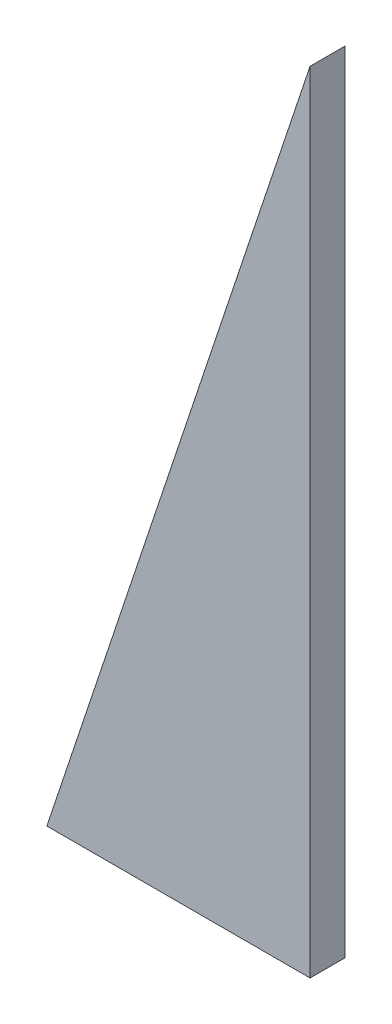
ISO-10303-21;
HEADER;
FILE_DESCRIPTION(('STEP AP214'),'2;1');
FILE_NAME('part.step','',(''),(''),'','','');
FILE_SCHEMA(('AUTOMOTIVE_DESIGN { 1 0 10303 214 1 1 1 1 }'));
ENDSEC;
DATA;
#1=APPLICATION_CONTEXT('core data for automotive mechanical design processes');
#2=APPLICATION_PROTOCOL_DEFINITION('international standard','automotive_design',2000,#1);
#3=PRODUCT_CONTEXT('',#1,'mechanical');
#4=PRODUCT('Part','Part','',(#3));
#5=PRODUCT_RELATED_PRODUCT_CATEGORY('part','',(#4));
#6=PRODUCT_DEFINITION_FORMATION('','',#4);
#7=PRODUCT_DEFINITION_CONTEXT('part definition',#1,'design');
#8=PRODUCT_DEFINITION('design','',#6,#7);
#9=PRODUCT_DEFINITION_SHAPE('','',#8);
#10=(LENGTH_UNIT() NAMED_UNIT(*) SI_UNIT(.MILLI.,.METRE.));
#11=(NAMED_UNIT(*) PLANE_ANGLE_UNIT() SI_UNIT($,.RADIAN.));
#12=(NAMED_UNIT(*) SI_UNIT($,.STERADIAN.) SOLID_ANGLE_UNIT());
#13=UNCERTAINTY_MEASURE_WITH_UNIT(LENGTH_MEASURE(1.E-05),#10,'distance_accuracy_value','');
#14=(GEOMETRIC_REPRESENTATION_CONTEXT(3) GLOBAL_UNCERTAINTY_ASSIGNED_CONTEXT((#13)) GLOBAL_UNIT_ASSIGNED_CONTEXT((#10,
#11,#12)) REPRESENTATION_CONTEXT('',''));
#15=CARTESIAN_POINT('',(0.,0.,0.));
#16=DIRECTION('',(0.,0.,1.));
#17=DIRECTION('',(1.,0.,0.));
#18=AXIS2_PLACEMENT_3D('',#15,#16,#17);
#19=CARTESIAN_POINT('',(-60.,0.,4.));
#20=DIRECTION('',(0.,1.,0.));
#21=DIRECTION('',(0.,0.,1.));
#22=AXIS2_PLACEMENT_3D('',#19,#20,#21);
#23=PLANE('',#22);
#24=DIRECTION('',(1.,0.,0.));
#25=VECTOR('',#24,1.);
#26=CARTESIAN_POINT('',(-60.,0.,-4.));
#27=LINE('',#26,#25);
#28=CARTESIAN_POINT('',(-60.,0.,-4.));
#29=VERTEX_POINT('',#28);
#30=CARTESIAN_POINT('',(0.,0.,-4.));
#31=VERTEX_POINT('',#30);
#32=EDGE_CURVE('E81',#29,#31,#27,.T.);
#33=ORIENTED_EDGE('',*,*,#32,.T.);
#34=DIRECTION('',(0.,0.,-1.));
#35=VECTOR('',#34,1.);
#36=CARTESIAN_POINT('',(0.,0.,4.));
#37=LINE('',#36,#35);
#38=CARTESIAN_POINT('',(0.,0.,4.));
#39=VERTEX_POINT('',#38);
#40=EDGE_CURVE('E11',#39,#31,#37,.T.);
#41=ORIENTED_EDGE('',*,*,#40,.F.);
#42=DIRECTION('',(1.,0.,0.));
#43=VECTOR('',#42,1.);
#44=CARTESIAN_POINT('',(-60.,0.,4.));
#45=LINE('',#44,#43);
#46=CARTESIAN_POINT('',(-60.,0.,4.));
#47=VERTEX_POINT('',#46);
#48=EDGE_CURVE('E74',#47,#39,#45,.T.);
#49=ORIENTED_EDGE('',*,*,#48,.F.);
#50=DIRECTION('',(0.,0.,-1.));
#51=VECTOR('',#50,1.);
#52=CARTESIAN_POINT('',(-60.,0.,4.));
#53=LINE('',#52,#51);
#54=EDGE_CURVE('E82',#47,#29,#53,.T.);
#55=ORIENTED_EDGE('',*,*,#54,.T.);
#56=EDGE_LOOP('',(#33,#41,#49,#55));
#57=FACE_BOUND('',#56,.T.);
#58=ADVANCED_FACE('F34',(#57),#23,.F.);
#59=CARTESIAN_POINT('',(0.,0.,4.));
#60=DIRECTION('',(-1.,0.,0.));
#61=DIRECTION('',(0.,0.,1.));
#62=AXIS2_PLACEMENT_3D('',#59,#60,#61);
#63=PLANE('',#62);
#64=DIRECTION('',(0.,1.,0.));
#65=VECTOR('',#64,1.);
#66=CARTESIAN_POINT('',(0.,0.,-4.));
#67=LINE('',#66,#65);
#68=CARTESIAN_POINT('',(0.,180.,-4.));
#69=VERTEX_POINT('',#68);
#70=EDGE_CURVE('E62',#31,#69,#67,.T.);
#71=ORIENTED_EDGE('',*,*,#70,.T.);
#72=DIRECTION('',(0.,0.,-1.));
#73=VECTOR('',#72,1.);
#74=CARTESIAN_POINT('',(0.,180.,4.));
#75=LINE('',#74,#73);
#76=CARTESIAN_POINT('',(0.,180.,4.));
#77=VERTEX_POINT('',#76);
#78=EDGE_CURVE('E42',#77,#69,#75,.T.);
#79=ORIENTED_EDGE('',*,*,#78,.F.);
#80=DIRECTION('',(0.,1.,0.));
#81=VECTOR('',#80,1.);
#82=CARTESIAN_POINT('',(0.,0.,4.));
#83=LINE('',#82,#81);
#84=EDGE_CURVE('E70',#39,#77,#83,.T.);
#85=ORIENTED_EDGE('',*,*,#84,.F.);
#86=ORIENTED_EDGE('',*,*,#40,.T.);
#87=EDGE_LOOP('',(#71,#79,#85,#86));
#88=FACE_BOUND('',#87,.T.);
#89=ADVANCED_FACE('F71',(#88),#63,.F.);
#90=CARTESIAN_POINT('',(0.,180.,4.));
#91=DIRECTION('',(0.948683298050514,-0.316227766016838,0.));
#92=DIRECTION('',(0.316227766016838,0.948683298050514,0.));
#93=AXIS2_PLACEMENT_3D('',#90,#91,#92);
#94=PLANE('',#93);
#95=DIRECTION('',(-0.316227766016838,-0.948683298050514,0.));
#96=VECTOR('',#95,1.);
#97=CARTESIAN_POINT('',(0.,180.,-4.));
#98=LINE('',#97,#96);
#99=EDGE_CURVE('E67',#69,#29,#98,.T.);
#100=ORIENTED_EDGE('',*,*,#99,.T.);
#101=ORIENTED_EDGE('',*,*,#54,.F.);
#102=DIRECTION('',(-0.316227766016838,-0.948683298050514,0.));
#103=VECTOR('',#102,1.);
#104=CARTESIAN_POINT('',(0.,180.,4.));
#105=LINE('',#104,#103);
#106=EDGE_CURVE('E50',#77,#47,#105,.T.);
#107=ORIENTED_EDGE('',*,*,#106,.F.);
#108=ORIENTED_EDGE('',*,*,#78,.T.);
#109=EDGE_LOOP('',(#100,#101,#107,#108));
#110=FACE_BOUND('',#109,.T.);
#111=ADVANCED_FACE('F89',(#110),#94,.F.);
#112=CARTESIAN_POINT('',(0.,0.,4.));
#113=DIRECTION('',(0.,0.,1.));
#114=DIRECTION('',(1.,0.,0.));
#115=AXIS2_PLACEMENT_3D('',#112,#113,#114);
#116=PLANE('',#115);
#117=ORIENTED_EDGE('',*,*,#48,.T.);
#118=ORIENTED_EDGE('',*,*,#84,.T.);
#119=ORIENTED_EDGE('',*,*,#106,.T.);
#120=EDGE_LOOP('',(#117,#118,#119));
#121=FACE_BOUND('',#120,.T.);
#122=ADVANCED_FACE('F77',(#121),#116,.T.);
#123=CARTESIAN_POINT('',(0.,0.,-4.));
#124=DIRECTION('',(0.,0.,1.));
#125=DIRECTION('',(1.,0.,0.));
#126=AXIS2_PLACEMENT_3D('',#123,#124,#125);
#127=PLANE('',#126);
#128=ORIENTED_EDGE('',*,*,#32,.F.);
#129=ORIENTED_EDGE('',*,*,#99,.F.);
#130=ORIENTED_EDGE('',*,*,#70,.F.);
#131=EDGE_LOOP('',(#128,#129,#130));
#132=FACE_BOUND('',#131,.T.);
#133=ADVANCED_FACE('F90',(#132),#127,.F.);
#134=CLOSED_SHELL('',(#58,#89,#111,#122,#133));
#135=MANIFOLD_SOLID_BREP('B2',#134);
#136=ADVANCED_BREP_SHAPE_REPRESENTATION('',(#18,#135),#14);
#137=SHAPE_DEFINITION_REPRESENTATION(#9,#136);
ENDSEC;
END-ISO-10303-21;
